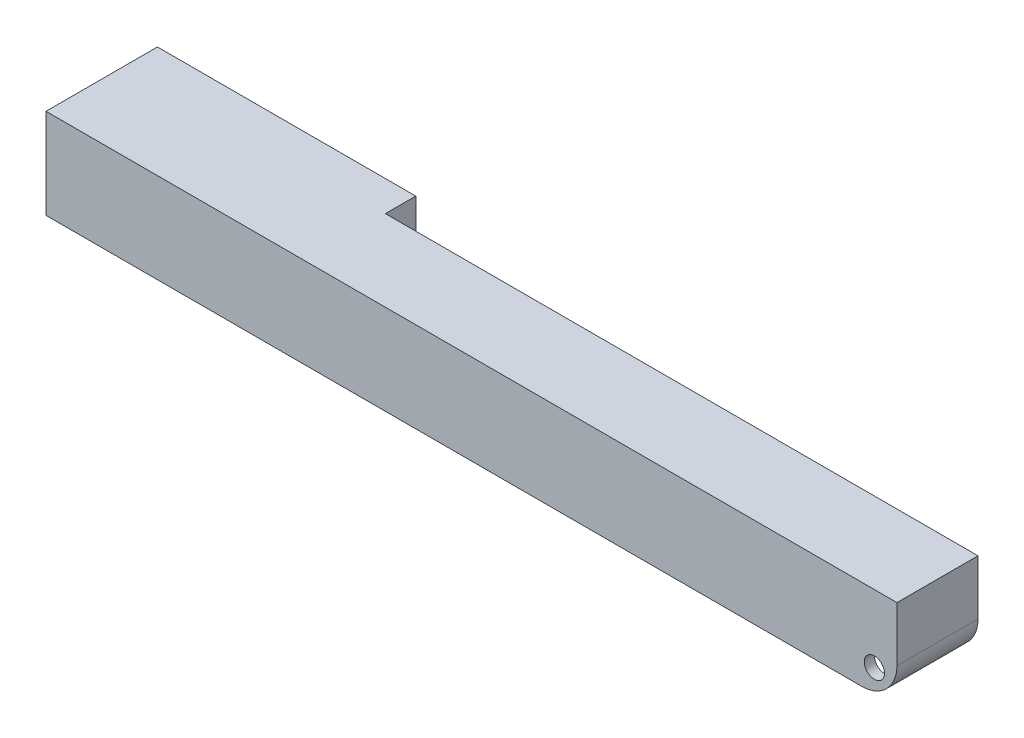
ISO-10303-21;
HEADER;
FILE_DESCRIPTION(('STEP AP214'),'2;1');
FILE_NAME('part.step','',(''),(''),'','','');
FILE_SCHEMA(('AUTOMOTIVE_DESIGN { 1 0 10303 214 1 1 1 1 }'));
ENDSEC;
DATA;
#1=APPLICATION_CONTEXT('core data for automotive mechanical design processes');
#2=APPLICATION_PROTOCOL_DEFINITION('international standard','automotive_design',2000,#1);
#3=PRODUCT_CONTEXT('',#1,'mechanical');
#4=PRODUCT('Part','Part','',(#3));
#5=PRODUCT_RELATED_PRODUCT_CATEGORY('part','',(#4));
#6=PRODUCT_DEFINITION_FORMATION('','',#4);
#7=PRODUCT_DEFINITION_CONTEXT('part definition',#1,'design');
#8=PRODUCT_DEFINITION('design','',#6,#7);
#9=PRODUCT_DEFINITION_SHAPE('','',#8);
#10=(LENGTH_UNIT() NAMED_UNIT(*) SI_UNIT(.MILLI.,.METRE.));
#11=(NAMED_UNIT(*) PLANE_ANGLE_UNIT() SI_UNIT($,.RADIAN.));
#12=(NAMED_UNIT(*) SI_UNIT($,.STERADIAN.) SOLID_ANGLE_UNIT());
#13=UNCERTAINTY_MEASURE_WITH_UNIT(LENGTH_MEASURE(1.E-05),#10,'distance_accuracy_value','');
#14=(GEOMETRIC_REPRESENTATION_CONTEXT(3) GLOBAL_UNCERTAINTY_ASSIGNED_CONTEXT((#13)) GLOBAL_UNIT_ASSIGNED_CONTEXT((#10,
#11,#12)) REPRESENTATION_CONTEXT('',''));
#15=CARTESIAN_POINT('',(0.,0.,0.));
#16=DIRECTION('',(0.,0.,1.));
#17=DIRECTION('',(1.,0.,0.));
#18=AXIS2_PLACEMENT_3D('',#15,#16,#17);
#19=CARTESIAN_POINT('',(82.,164.984847789123,9.));
#20=DIRECTION('',(0.,0.,1.));
#21=DIRECTION('',(1.,0.,0.));
#22=AXIS2_PLACEMENT_3D('',#19,#20,#21);
#23=PLANE('',#22);
#24=CARTESIAN_POINT('',(79.55,-13.35,9.));
#25=DIRECTION('',(0.,0.,1.));
#26=DIRECTION('',(1.,0.,0.));
#27=AXIS2_PLACEMENT_3D('',#24,#25,#26);
#28=CIRCLE('',#27,2.);
#29=CARTESIAN_POINT('',(81.55,-13.35,9.));
#30=VERTEX_POINT('',#29);
#31=EDGE_CURVE('E292',#30,#30,#28,.F.);
#32=ORIENTED_EDGE('',*,*,#31,.F.);
#33=EDGE_LOOP('',(#32));
#34=FACE_BOUND('',#33,.T.);
#35=DIRECTION('',(0.,-1.,0.));
#36=VECTOR('',#35,1.);
#37=CARTESIAN_POINT('',(82.,164.984847789123,9.));
#38=LINE('',#37,#36);
#39=CARTESIAN_POINT('',(82.,-2.,9.));
#40=VERTEX_POINT('',#39);
#41=CARTESIAN_POINT('',(82.,-15.6989794855664,9.));
#42=VERTEX_POINT('',#41);
#43=EDGE_CURVE('E247',#40,#42,#38,.T.);
#44=ORIENTED_EDGE('',*,*,#43,.T.);
#45=CARTESIAN_POINT('',(77.,-10.8,9.));
#46=DIRECTION('',(0.,0.,1.));
#47=DIRECTION('',(1.,0.,0.));
#48=AXIS2_PLACEMENT_3D('',#45,#46,#47);
#49=CIRCLE('',#48,7.);
#50=CARTESIAN_POINT('',(77.,-17.8,9.));
#51=VERTEX_POINT('',#50);
#52=EDGE_CURVE('E56',#42,#51,#49,.F.);
#53=ORIENTED_EDGE('',*,*,#52,.T.);
#54=DIRECTION('',(-1.,0.,0.));
#55=VECTOR('',#54,1.);
#56=CARTESIAN_POINT('',(82.,-17.8,9.));
#57=LINE('',#56,#55);
#58=CARTESIAN_POINT('',(-82.,-17.8,8.99999999999998));
#59=VERTEX_POINT('',#58);
#60=EDGE_CURVE('E245',#51,#59,#57,.T.);
#61=ORIENTED_EDGE('',*,*,#60,.T.);
#62=DIRECTION('',(0.,-1.,0.));
#63=VECTOR('',#62,1.);
#64=CARTESIAN_POINT('',(-82.,164.984847789123,8.99999999999998));
#65=LINE('',#64,#63);
#66=CARTESIAN_POINT('',(-82.,-14.3,8.99999999999998));
#67=VERTEX_POINT('',#66);
#68=EDGE_CURVE('E303',#67,#59,#65,.T.);
#69=ORIENTED_EDGE('',*,*,#68,.F.);
#70=DIRECTION('',(1.,0.,0.));
#71=VECTOR('',#70,1.);
#72=CARTESIAN_POINT('',(-82.,-14.3,8.99999999999998));
#73=LINE('',#72,#71);
#74=CARTESIAN_POINT('',(-35.,-14.3,8.99999999999999));
#75=VERTEX_POINT('',#74);
#76=EDGE_CURVE('E695',#67,#75,#73,.T.);
#77=ORIENTED_EDGE('',*,*,#76,.T.);
#78=DIRECTION('',(0.,1.,0.));
#79=VECTOR('',#78,1.);
#80=CARTESIAN_POINT('',(-35.,-12.3,8.99999999999999));
#81=LINE('',#80,#79);
#82=CARTESIAN_POINT('',(-35.,-12.3,8.99999999999999));
#83=VERTEX_POINT('',#82);
#84=EDGE_CURVE('E260',#75,#83,#81,.T.);
#85=ORIENTED_EDGE('',*,*,#84,.T.);
#86=DIRECTION('',(-1.,0.,0.));
#87=VECTOR('',#86,1.);
#88=CARTESIAN_POINT('',(-82.,-12.3,8.99999999999998));
#89=LINE('',#88,#87);
#90=CARTESIAN_POINT('',(-82.,-12.3,8.99999999999998));
#91=VERTEX_POINT('',#90);
#92=EDGE_CURVE('E203',#83,#91,#89,.T.);
#93=ORIENTED_EDGE('',*,*,#92,.T.);
#94=CARTESIAN_POINT('',(-82.,-2.,8.99999999999998));
#95=VERTEX_POINT('',#94);
#96=EDGE_CURVE('E295',#95,#91,#65,.T.);
#97=ORIENTED_EDGE('',*,*,#96,.F.);
#98=DIRECTION('',(-1.,0.,0.));
#99=VECTOR('',#98,1.);
#100=CARTESIAN_POINT('',(82.,-2.,9.));
#101=LINE('',#100,#99);
#102=EDGE_CURVE('E308',#40,#95,#101,.T.);
#103=ORIENTED_EDGE('',*,*,#102,.F.);
#104=EDGE_LOOP('',(#44,#53,#61,#69,#77,#85,#93,#97,#103));
#105=FACE_BOUND('',#104,.T.);
#106=ADVANCED_FACE('F47',(#34,#105),#23,.F.);
#107=CARTESIAN_POINT('',(-82.,164.984847789123,8.99999999999998));
#108=DIRECTION('',(-1.,0.,0.));
#109=DIRECTION('',(0.,0.,1.));
#110=AXIS2_PLACEMENT_3D('',#107,#108,#109);
#111=PLANE('',#110);
#112=DIRECTION('',(0.,0.,-1.));
#113=VECTOR('',#112,1.);
#114=CARTESIAN_POINT('',(-82.,-14.3,56.0425339453563));
#115=LINE('',#114,#113);
#116=CARTESIAN_POINT('',(-82.,-14.3,-9.));
#117=VERTEX_POINT('',#116);
#118=EDGE_CURVE('E633',#67,#117,#115,.T.);
#119=ORIENTED_EDGE('',*,*,#118,.F.);
#120=ORIENTED_EDGE('',*,*,#68,.T.);
#121=DIRECTION('',(0.,0.,-1.));
#122=VECTOR('',#121,1.);
#123=CARTESIAN_POINT('',(-82.,-17.8,8.99999999999998));
#124=LINE('',#123,#122);
#125=CARTESIAN_POINT('',(-82.,-17.8,-9.));
#126=VERTEX_POINT('',#125);
#127=EDGE_CURVE('E258',#59,#126,#124,.T.);
#128=ORIENTED_EDGE('',*,*,#127,.T.);
#129=DIRECTION('',(0.,-1.,0.));
#130=VECTOR('',#129,1.);
#131=CARTESIAN_POINT('',(-82.,164.984847789123,-9.));
#132=LINE('',#131,#130);
#133=EDGE_CURVE('E658',#117,#126,#132,.T.);
#134=ORIENTED_EDGE('',*,*,#133,.F.);
#135=EDGE_LOOP('',(#119,#120,#128,#134));
#136=FACE_BOUND('',#135,.T.);
#137=ADVANCED_FACE('F394',(#136),#111,.F.);
#138=DIRECTION('',(0.,0.,-1.));
#139=VECTOR('',#138,1.);
#140=CARTESIAN_POINT('',(-82.,-12.3,56.0425339453563));
#141=LINE('',#140,#139);
#142=CARTESIAN_POINT('',(-82.,-12.3,-9.));
#143=VERTEX_POINT('',#142);
#144=EDGE_CURVE('E630',#91,#143,#141,.T.);
#145=ORIENTED_EDGE('',*,*,#144,.T.);
#146=CARTESIAN_POINT('',(-82.,-2.,-9.));
#147=VERTEX_POINT('',#146);
#148=EDGE_CURVE('E199',#147,#143,#132,.T.);
#149=ORIENTED_EDGE('',*,*,#148,.F.);
#150=DIRECTION('',(0.,0.,-1.));
#151=VECTOR('',#150,1.);
#152=CARTESIAN_POINT('',(-82.,-2.,8.99999999999998));
#153=LINE('',#152,#151);
#154=EDGE_CURVE('E645',#95,#147,#153,.T.);
#155=ORIENTED_EDGE('',*,*,#154,.F.);
#156=ORIENTED_EDGE('',*,*,#96,.T.);
#157=EDGE_LOOP('',(#145,#149,#155,#156));
#158=FACE_BOUND('',#157,.T.);
#159=ADVANCED_FACE('F400',(#158),#111,.F.);
#160=CARTESIAN_POINT('',(-82.,164.984847789123,-9.));
#161=DIRECTION('',(0.,0.,-1.));
#162=DIRECTION('',(-1.,0.,0.));
#163=AXIS2_PLACEMENT_3D('',#160,#161,#162);
#164=PLANE('',#163);
#165=DIRECTION('',(1.,0.,0.));
#166=VECTOR('',#165,1.);
#167=CARTESIAN_POINT('',(-82.,-14.3,-9.));
#168=LINE('',#167,#166);
#169=CARTESIAN_POINT('',(-35.,-14.3,-9.));
#170=VERTEX_POINT('',#169);
#171=EDGE_CURVE('E637',#117,#170,#168,.T.);
#172=ORIENTED_EDGE('',*,*,#171,.F.);
#173=ORIENTED_EDGE('',*,*,#133,.T.);
#174=DIRECTION('',(1.,0.,0.));
#175=VECTOR('',#174,1.);
#176=CARTESIAN_POINT('',(-82.,-17.8,-9.));
#177=LINE('',#176,#175);
#178=CARTESIAN_POINT('',(-35.,-17.8,-9.));
#179=VERTEX_POINT('',#178);
#180=EDGE_CURVE('E650',#126,#179,#177,.T.);
#181=ORIENTED_EDGE('',*,*,#180,.T.);
#182=DIRECTION('',(0.,-1.,0.));
#183=VECTOR('',#182,1.);
#184=CARTESIAN_POINT('',(-35.,164.984847789123,-9.));
#185=LINE('',#184,#183);
#186=EDGE_CURVE('E192',#170,#179,#185,.T.);
#187=ORIENTED_EDGE('',*,*,#186,.F.);
#188=EDGE_LOOP('',(#172,#173,#181,#187));
#189=FACE_BOUND('',#188,.T.);
#190=ADVANCED_FACE('F417',(#189),#164,.F.);
#191=DIRECTION('',(-1.,0.,0.));
#192=VECTOR('',#191,1.);
#193=CARTESIAN_POINT('',(-82.,-12.3,-9.));
#194=LINE('',#193,#192);
#195=CARTESIAN_POINT('',(-35.,-12.3,-9.));
#196=VERTEX_POINT('',#195);
#197=EDGE_CURVE('E196',#196,#143,#194,.T.);
#198=ORIENTED_EDGE('',*,*,#197,.F.);
#199=CARTESIAN_POINT('',(-35.,-2.,-9.));
#200=VERTEX_POINT('',#199);
#201=EDGE_CURVE('E180',#200,#196,#185,.T.);
#202=ORIENTED_EDGE('',*,*,#201,.F.);
#203=DIRECTION('',(1.,0.,0.));
#204=VECTOR('',#203,1.);
#205=CARTESIAN_POINT('',(-82.,-2.,-9.));
#206=LINE('',#205,#204);
#207=EDGE_CURVE('E675',#147,#200,#206,.T.);
#208=ORIENTED_EDGE('',*,*,#207,.F.);
#209=ORIENTED_EDGE('',*,*,#148,.T.);
#210=EDGE_LOOP('',(#198,#202,#208,#209));
#211=FACE_BOUND('',#210,.T.);
#212=ADVANCED_FACE('F197',(#211),#164,.F.);
#213=CARTESIAN_POINT('',(-35.,164.984847789123,-9.));
#214=DIRECTION('',(1.,0.,0.));
#215=DIRECTION('',(0.,0.,-1.));
#216=AXIS2_PLACEMENT_3D('',#213,#214,#215);
#217=PLANE('',#216);
#218=DIRECTION('',(0.,0.,1.));
#219=VECTOR('',#218,1.);
#220=CARTESIAN_POINT('',(-35.,-14.3,-9.));
#221=LINE('',#220,#219);
#222=CARTESIAN_POINT('',(-35.,-14.3,-3.));
#223=VERTEX_POINT('',#222);
#224=EDGE_CURVE('E211',#170,#223,#221,.T.);
#225=ORIENTED_EDGE('',*,*,#224,.F.);
#226=ORIENTED_EDGE('',*,*,#186,.T.);
#227=DIRECTION('',(0.,0.,1.));
#228=VECTOR('',#227,1.);
#229=CARTESIAN_POINT('',(-35.,-17.8,-9.));
#230=LINE('',#229,#228);
#231=CARTESIAN_POINT('',(-35.,-17.8,-3.));
#232=VERTEX_POINT('',#231);
#233=EDGE_CURVE('E646',#179,#232,#230,.T.);
#234=ORIENTED_EDGE('',*,*,#233,.T.);
#235=DIRECTION('',(0.,-1.,0.));
#236=VECTOR('',#235,1.);
#237=CARTESIAN_POINT('',(-35.,164.984847789123,-3.));
#238=LINE('',#237,#236);
#239=EDGE_CURVE('E674',#223,#232,#238,.T.);
#240=ORIENTED_EDGE('',*,*,#239,.F.);
#241=EDGE_LOOP('',(#225,#226,#234,#240));
#242=FACE_BOUND('',#241,.T.);
#243=ADVANCED_FACE('F388',(#242),#217,.F.);
#244=DIRECTION('',(0.,0.,-1.));
#245=VECTOR('',#244,1.);
#246=CARTESIAN_POINT('',(-35.,-12.3,-9.));
#247=LINE('',#246,#245);
#248=CARTESIAN_POINT('',(-35.,-12.3,-3.));
#249=VERTEX_POINT('',#248);
#250=EDGE_CURVE('E185',#249,#196,#247,.T.);
#251=ORIENTED_EDGE('',*,*,#250,.F.);
#252=CARTESIAN_POINT('',(-35.,-2.,-3.));
#253=VERTEX_POINT('',#252);
#254=EDGE_CURVE('E671',#253,#249,#238,.T.);
#255=ORIENTED_EDGE('',*,*,#254,.F.);
#256=DIRECTION('',(0.,0.,1.));
#257=VECTOR('',#256,1.);
#258=CARTESIAN_POINT('',(-35.,-2.,-9.));
#259=LINE('',#258,#257);
#260=EDGE_CURVE('E188',#200,#253,#259,.T.);
#261=ORIENTED_EDGE('',*,*,#260,.F.);
#262=ORIENTED_EDGE('',*,*,#201,.T.);
#263=EDGE_LOOP('',(#251,#255,#261,#262));
#264=FACE_BOUND('',#263,.T.);
#265=ADVANCED_FACE('F182',(#264),#217,.F.);
#266=CARTESIAN_POINT('',(79.55,-13.35,-16.6568542494924));
#267=DIRECTION('',(0.,0.,1.));
#268=DIRECTION('',(1.,0.,0.));
#269=AXIS2_PLACEMENT_3D('',#266,#267,#268);
#270=CYLINDRICAL_SURFACE('',#269,2.);
#271=CARTESIAN_POINT('',(79.55,-13.35,-3.));
#272=DIRECTION('',(0.,0.,-1.));
#273=DIRECTION('',(-1.,0.,0.));
#274=AXIS2_PLACEMENT_3D('',#271,#272,#273);
#275=CIRCLE('',#274,2.);
#276=CARTESIAN_POINT('',(77.55,-13.35,-3.));
#277=VERTEX_POINT('',#276);
#278=EDGE_CURVE('E222',#277,#277,#275,.F.);
#279=ORIENTED_EDGE('',*,*,#278,.T.);
#280=EDGE_LOOP('',(#279));
#281=FACE_BOUND('',#280,.T.);
#282=CARTESIAN_POINT('',(79.55,-13.35,-5.));
#283=DIRECTION('',(0.,0.,1.));
#284=DIRECTION('',(1.,0.,0.));
#285=AXIS2_PLACEMENT_3D('',#282,#283,#284);
#286=CIRCLE('',#285,2.);
#287=CARTESIAN_POINT('',(81.55,-13.35,-5.));
#288=VERTEX_POINT('',#287);
#289=EDGE_CURVE('E287',#288,#288,#286,.F.);
#290=ORIENTED_EDGE('',*,*,#289,.T.);
#291=EDGE_LOOP('',(#290));
#292=FACE_BOUND('',#291,.T.);
#293=ADVANCED_FACE('F379',(#281,#292),#270,.F.);
#294=CARTESIAN_POINT('',(-84.,-17.8,11.));
#295=DIRECTION('',(0.,0.,1.));
#296=DIRECTION('',(1.,0.,0.));
#297=AXIS2_PLACEMENT_3D('',#294,#295,#296);
#298=PLANE('',#297);
#299=CARTESIAN_POINT('',(79.55,-13.35,11.));
#300=DIRECTION('',(0.,0.,1.));
#301=DIRECTION('',(1.,0.,0.));
#302=AXIS2_PLACEMENT_3D('',#299,#300,#301);
#303=CIRCLE('',#302,2.);
#304=CARTESIAN_POINT('',(81.55,-13.35,11.));
#305=VERTEX_POINT('',#304);
#306=EDGE_CURVE('E290',#305,#305,#303,.T.);
#307=ORIENTED_EDGE('',*,*,#306,.F.);
#308=EDGE_LOOP('',(#307));
#309=FACE_BOUND('',#308,.T.);
#310=DIRECTION('',(1.,0.,0.));
#311=VECTOR('',#310,1.);
#312=CARTESIAN_POINT('',(-84.,-17.8,11.));
#313=LINE('',#312,#311);
#314=CARTESIAN_POINT('',(-84.,-17.8,11.));
#315=VERTEX_POINT('',#314);
#316=CARTESIAN_POINT('',(77.,-17.8,11.));
#317=VERTEX_POINT('',#316);
#318=EDGE_CURVE('E270',#315,#317,#313,.T.);
#319=ORIENTED_EDGE('',*,*,#318,.T.);
#320=CARTESIAN_POINT('',(77.,-10.8,11.));
#321=DIRECTION('',(0.,0.,1.));
#322=DIRECTION('',(1.,0.,0.));
#323=AXIS2_PLACEMENT_3D('',#320,#321,#322);
#324=CIRCLE('',#323,7.);
#325=CARTESIAN_POINT('',(84.,-10.8,11.));
#326=VERTEX_POINT('',#325);
#327=EDGE_CURVE('E12',#317,#326,#324,.T.);
#328=ORIENTED_EDGE('',*,*,#327,.T.);
#329=DIRECTION('',(0.,1.,0.));
#330=VECTOR('',#329,1.);
#331=CARTESIAN_POINT('',(84.,-17.8,11.));
#332=LINE('',#331,#330);
#333=CARTESIAN_POINT('',(84.,0.,11.));
#334=VERTEX_POINT('',#333);
#335=EDGE_CURVE('E268',#326,#334,#332,.T.);
#336=ORIENTED_EDGE('',*,*,#335,.T.);
#337=DIRECTION('',(1.,0.,0.));
#338=VECTOR('',#337,1.);
#339=CARTESIAN_POINT('',(-84.,0.,11.));
#340=LINE('',#339,#338);
#341=CARTESIAN_POINT('',(-84.,0.,11.));
#342=VERTEX_POINT('',#341);
#343=EDGE_CURVE('E335',#342,#334,#340,.T.);
#344=ORIENTED_EDGE('',*,*,#343,.F.);
#345=DIRECTION('',(0.,1.,0.));
#346=VECTOR('',#345,1.);
#347=CARTESIAN_POINT('',(-84.,-17.8,11.));
#348=LINE('',#347,#346);
#349=EDGE_CURVE('E212',#315,#342,#348,.T.);
#350=ORIENTED_EDGE('',*,*,#349,.F.);
#351=EDGE_LOOP('',(#319,#328,#336,#344,#350));
#352=FACE_BOUND('',#351,.T.);
#353=ADVANCED_FACE('F266',(#309,#352),#298,.T.);
#354=CARTESIAN_POINT('',(-84.,-17.8,11.));
#355=DIRECTION('',(1.,0.,0.));
#356=DIRECTION('',(0.,0.,-1.));
#357=AXIS2_PLACEMENT_3D('',#354,#355,#356);
#358=PLANE('',#357);
#359=DIRECTION('',(0.,0.,-1.));
#360=VECTOR('',#359,1.);
#361=CARTESIAN_POINT('',(-84.,0.,11.));
#362=LINE('',#361,#360);
#363=CARTESIAN_POINT('',(-84.,0.,-11.));
#364=VERTEX_POINT('',#363);
#365=EDGE_CURVE('E338',#342,#364,#362,.T.);
#366=ORIENTED_EDGE('',*,*,#365,.T.);
#367=DIRECTION('',(0.,1.,0.));
#368=VECTOR('',#367,1.);
#369=CARTESIAN_POINT('',(-84.,-17.8,-11.));
#370=LINE('',#369,#368);
#371=CARTESIAN_POINT('',(-84.,-17.8,-11.));
#372=VERTEX_POINT('',#371);
#373=EDGE_CURVE('E219',#372,#364,#370,.T.);
#374=ORIENTED_EDGE('',*,*,#373,.F.);
#375=DIRECTION('',(0.,0.,-1.));
#376=VECTOR('',#375,1.);
#377=CARTESIAN_POINT('',(-84.,-17.8,11.));
#378=LINE('',#377,#376);
#379=EDGE_CURVE('E278',#315,#372,#378,.T.);
#380=ORIENTED_EDGE('',*,*,#379,.F.);
#381=ORIENTED_EDGE('',*,*,#349,.T.);
#382=EDGE_LOOP('',(#366,#374,#380,#381));
#383=FACE_BOUND('',#382,.T.);
#384=ADVANCED_FACE('F354',(#383),#358,.F.);
#385=CARTESIAN_POINT('',(-84.,-17.8,-11.));
#386=DIRECTION('',(0.,0.,1.));
#387=DIRECTION('',(1.,0.,0.));
#388=AXIS2_PLACEMENT_3D('',#385,#386,#387);
#389=PLANE('',#388);
#390=DIRECTION('',(1.,0.,0.));
#391=VECTOR('',#390,1.);
#392=CARTESIAN_POINT('',(-84.,0.,-11.));
#393=LINE('',#392,#391);
#394=CARTESIAN_POINT('',(-33.,0.,-11.));
#395=VERTEX_POINT('',#394);
#396=EDGE_CURVE('E346',#364,#395,#393,.T.);
#397=ORIENTED_EDGE('',*,*,#396,.T.);
#398=DIRECTION('',(0.,1.,0.));
#399=VECTOR('',#398,1.);
#400=CARTESIAN_POINT('',(-33.,-134.9537451386,-11.));
#401=LINE('',#400,#399);
#402=CARTESIAN_POINT('',(-33.,-17.8,-11.));
#403=VERTEX_POINT('',#402);
#404=EDGE_CURVE('E324',#403,#395,#401,.T.);
#405=ORIENTED_EDGE('',*,*,#404,.F.);
#406=DIRECTION('',(1.,0.,0.));
#407=VECTOR('',#406,1.);
#408=CARTESIAN_POINT('',(-84.,-17.8,-11.));
#409=LINE('',#408,#407);
#410=EDGE_CURVE('E284',#372,#403,#409,.T.);
#411=ORIENTED_EDGE('',*,*,#410,.F.);
#412=ORIENTED_EDGE('',*,*,#373,.T.);
#413=EDGE_LOOP('',(#397,#405,#411,#412));
#414=FACE_BOUND('',#413,.T.);
#415=ADVANCED_FACE('F360',(#414),#389,.F.);
#416=CARTESIAN_POINT('',(84.,-17.8,11.));
#417=DIRECTION('',(1.,0.,0.));
#418=DIRECTION('',(0.,0.,-1.));
#419=AXIS2_PLACEMENT_3D('',#416,#417,#418);
#420=PLANE('',#419);
#421=ORIENTED_EDGE('',*,*,#335,.F.);
#422=DIRECTION('',(0.,0.,-1.));
#423=VECTOR('',#422,1.);
#424=CARTESIAN_POINT('',(84.,-10.8,-5.));
#425=LINE('',#424,#423);
#426=CARTESIAN_POINT('',(84.,-10.8,-5.));
#427=VERTEX_POINT('',#426);
#428=EDGE_CURVE('E217',#326,#427,#425,.T.);
#429=ORIENTED_EDGE('',*,*,#428,.T.);
#430=DIRECTION('',(0.,1.,0.));
#431=VECTOR('',#430,1.);
#432=CARTESIAN_POINT('',(84.,-134.9537451386,-5.));
#433=LINE('',#432,#431);
#434=CARTESIAN_POINT('',(84.,0.,-5.));
#435=VERTEX_POINT('',#434);
#436=EDGE_CURVE('E314',#427,#435,#433,.T.);
#437=ORIENTED_EDGE('',*,*,#436,.T.);
#438=DIRECTION('',(0.,0.,-1.));
#439=VECTOR('',#438,1.);
#440=CARTESIAN_POINT('',(84.,0.,11.));
#441=LINE('',#440,#439);
#442=EDGE_CURVE('E275',#334,#435,#441,.T.);
#443=ORIENTED_EDGE('',*,*,#442,.F.);
#444=EDGE_LOOP('',(#421,#429,#437,#443));
#445=FACE_BOUND('',#444,.T.);
#446=ADVANCED_FACE('F272',(#445),#420,.T.);
#447=CARTESIAN_POINT('',(0.,-17.8,0.));
#448=DIRECTION('',(0.,1.,0.));
#449=DIRECTION('',(0.,0.,1.));
#450=AXIS2_PLACEMENT_3D('',#447,#448,#449);
#451=PLANE('',#450);
#452=DIRECTION('',(-1.,0.,0.));
#453=VECTOR('',#452,1.);
#454=CARTESIAN_POINT('',(-33.,-17.8,-5.));
#455=LINE('',#454,#453);
#456=CARTESIAN_POINT('',(77.,-17.8,-5.));
#457=VERTEX_POINT('',#456);
#458=CARTESIAN_POINT('',(-33.,-17.8,-5.));
#459=VERTEX_POINT('',#458);
#460=EDGE_CURVE('E291',#457,#459,#455,.T.);
#461=ORIENTED_EDGE('',*,*,#460,.F.);
#462=DIRECTION('',(0.,0.,-1.));
#463=VECTOR('',#462,1.);
#464=CARTESIAN_POINT('',(77.,-17.8,11.));
#465=LINE('',#464,#463);
#466=CARTESIAN_POINT('',(77.,-17.8,-3.));
#467=VERTEX_POINT('',#466);
#468=EDGE_CURVE('E234',#457,#467,#465,.F.);
#469=ORIENTED_EDGE('',*,*,#468,.T.);
#470=DIRECTION('',(1.,0.,0.));
#471=VECTOR('',#470,1.);
#472=CARTESIAN_POINT('',(-35.,-17.8,-3.));
#473=LINE('',#472,#471);
#474=EDGE_CURVE('E642',#232,#467,#473,.T.);
#475=ORIENTED_EDGE('',*,*,#474,.F.);
#476=ORIENTED_EDGE('',*,*,#233,.F.);
#477=ORIENTED_EDGE('',*,*,#180,.F.);
#478=ORIENTED_EDGE('',*,*,#127,.F.);
#479=ORIENTED_EDGE('',*,*,#60,.F.);
#480=DIRECTION('',(0.,0.,-1.));
#481=VECTOR('',#480,1.);
#482=CARTESIAN_POINT('',(77.,-17.8,11.));
#483=LINE('',#482,#481);
#484=EDGE_CURVE('E231',#51,#317,#483,.F.);
#485=ORIENTED_EDGE('',*,*,#484,.T.);
#486=ORIENTED_EDGE('',*,*,#318,.F.);
#487=ORIENTED_EDGE('',*,*,#379,.T.);
#488=ORIENTED_EDGE('',*,*,#410,.T.);
#489=DIRECTION('',(0.,0.,-1.));
#490=VECTOR('',#489,1.);
#491=CARTESIAN_POINT('',(-33.,-17.8,-11.));
#492=LINE('',#491,#490);
#493=EDGE_CURVE('E311',#459,#403,#492,.T.);
#494=ORIENTED_EDGE('',*,*,#493,.F.);
#495=EDGE_LOOP('',(#461,#469,#475,#476,#477,#478,#479,#485,#486,#487,#488,#494));
#496=FACE_BOUND('',#495,.T.);
#497=ADVANCED_FACE('F253',(#496),#451,.F.);
#498=CARTESIAN_POINT('',(0.,0.,0.));
#499=DIRECTION('',(0.,1.,0.));
#500=DIRECTION('',(0.,0.,1.));
#501=AXIS2_PLACEMENT_3D('',#498,#499,#500);
#502=PLANE('',#501);
#503=DIRECTION('',(1.,0.,0.));
#504=VECTOR('',#503,1.);
#505=CARTESIAN_POINT('',(-33.,0.,-5.));
#506=LINE('',#505,#504);
#507=CARTESIAN_POINT('',(-33.,0.,-5.));
#508=VERTEX_POINT('',#507);
#509=EDGE_CURVE('E320',#508,#435,#506,.T.);
#510=ORIENTED_EDGE('',*,*,#509,.F.);
#511=DIRECTION('',(0.,0.,1.));
#512=VECTOR('',#511,1.);
#513=CARTESIAN_POINT('',(-33.,0.,-11.));
#514=LINE('',#513,#512);
#515=EDGE_CURVE('E301',#395,#508,#514,.T.);
#516=ORIENTED_EDGE('',*,*,#515,.F.);
#517=ORIENTED_EDGE('',*,*,#396,.F.);
#518=ORIENTED_EDGE('',*,*,#365,.F.);
#519=ORIENTED_EDGE('',*,*,#343,.T.);
#520=ORIENTED_EDGE('',*,*,#442,.T.);
#521=EDGE_LOOP('',(#510,#516,#517,#518,#519,#520));
#522=FACE_BOUND('',#521,.T.);
#523=ADVANCED_FACE('F364',(#522),#502,.T.);
#524=ORIENTED_EDGE('',*,*,#31,.T.);
#525=EDGE_LOOP('',(#524));
#526=FACE_BOUND('',#525,.T.);
#527=ORIENTED_EDGE('',*,*,#306,.T.);
#528=EDGE_LOOP('',(#527));
#529=FACE_BOUND('',#528,.T.);
#530=ADVANCED_FACE('F375',(#526,#529),#270,.F.);
#531=CARTESIAN_POINT('',(-33.,-134.9537451386,-5.));
#532=DIRECTION('',(0.,0.,1.));
#533=DIRECTION('',(1.,0.,0.));
#534=AXIS2_PLACEMENT_3D('',#531,#532,#533);
#535=PLANE('',#534);
#536=ORIENTED_EDGE('',*,*,#436,.F.);
#537=CARTESIAN_POINT('',(77.,-10.8,-5.));
#538=DIRECTION('',(0.,0.,1.));
#539=DIRECTION('',(1.,0.,0.));
#540=AXIS2_PLACEMENT_3D('',#537,#538,#539);
#541=CIRCLE('',#540,7.);
#542=EDGE_CURVE('E228',#427,#457,#541,.F.);
#543=ORIENTED_EDGE('',*,*,#542,.T.);
#544=ORIENTED_EDGE('',*,*,#460,.T.);
#545=DIRECTION('',(0.,1.,0.));
#546=VECTOR('',#545,1.);
#547=CARTESIAN_POINT('',(-33.,-134.9537451386,-5.));
#548=LINE('',#547,#546);
#549=EDGE_CURVE('E327',#459,#508,#548,.T.);
#550=ORIENTED_EDGE('',*,*,#549,.T.);
#551=ORIENTED_EDGE('',*,*,#509,.T.);
#552=EDGE_LOOP('',(#536,#543,#544,#550,#551));
#553=FACE_BOUND('',#552,.T.);
#554=ORIENTED_EDGE('',*,*,#289,.F.);
#555=EDGE_LOOP('',(#554));
#556=FACE_BOUND('',#555,.T.);
#557=ADVANCED_FACE('F372',(#553,#556),#535,.F.);
#558=CARTESIAN_POINT('',(-33.,-134.9537451386,-11.));
#559=DIRECTION('',(-1.,0.,0.));
#560=DIRECTION('',(0.,0.,1.));
#561=AXIS2_PLACEMENT_3D('',#558,#559,#560);
#562=PLANE('',#561);
#563=ORIENTED_EDGE('',*,*,#493,.T.);
#564=ORIENTED_EDGE('',*,*,#404,.T.);
#565=ORIENTED_EDGE('',*,*,#515,.T.);
#566=ORIENTED_EDGE('',*,*,#549,.F.);
#567=EDGE_LOOP('',(#563,#564,#565,#566));
#568=FACE_BOUND('',#567,.T.);
#569=ADVANCED_FACE('F367',(#568),#562,.F.);
#570=CARTESIAN_POINT('',(-35.,164.984847789123,-3.));
#571=DIRECTION('',(0.,0.,-1.));
#572=DIRECTION('',(-1.,0.,0.));
#573=AXIS2_PLACEMENT_3D('',#570,#571,#572);
#574=PLANE('',#573);
#575=ORIENTED_EDGE('',*,*,#474,.T.);
#576=CARTESIAN_POINT('',(77.,-10.8,-3.));
#577=DIRECTION('',(0.,0.,-1.));
#578=DIRECTION('',(-1.,0.,0.));
#579=AXIS2_PLACEMENT_3D('',#576,#577,#578);
#580=CIRCLE('',#579,7.);
#581=CARTESIAN_POINT('',(82.,-15.6989794855664,-3.));
#582=VERTEX_POINT('',#581);
#583=EDGE_CURVE('E71',#467,#582,#580,.F.);
#584=ORIENTED_EDGE('',*,*,#583,.T.);
#585=DIRECTION('',(0.,-1.,0.));
#586=VECTOR('',#585,1.);
#587=CARTESIAN_POINT('',(82.,164.984847789123,-3.));
#588=LINE('',#587,#586);
#589=CARTESIAN_POINT('',(82.,-2.,-3.));
#590=VERTEX_POINT('',#589);
#591=EDGE_CURVE('E666',#590,#582,#588,.T.);
#592=ORIENTED_EDGE('',*,*,#591,.F.);
#593=DIRECTION('',(1.,0.,0.));
#594=VECTOR('',#593,1.);
#595=CARTESIAN_POINT('',(-35.,-2.,-3.));
#596=LINE('',#595,#594);
#597=EDGE_CURVE('E667',#253,#590,#596,.T.);
#598=ORIENTED_EDGE('',*,*,#597,.F.);
#599=ORIENTED_EDGE('',*,*,#254,.T.);
#600=EDGE_CURVE('E683',#249,#223,#238,.T.);
#601=ORIENTED_EDGE('',*,*,#600,.T.);
#602=ORIENTED_EDGE('',*,*,#239,.T.);
#603=EDGE_LOOP('',(#575,#584,#592,#598,#599,#601,#602));
#604=FACE_BOUND('',#603,.T.);
#605=ORIENTED_EDGE('',*,*,#278,.F.);
#606=EDGE_LOOP('',(#605));
#607=FACE_BOUND('',#606,.T.);
#608=ADVANCED_FACE('F412',(#604,#607),#574,.F.);
#609=CARTESIAN_POINT('',(0.,-2.,0.));
#610=DIRECTION('',(0.,1.,0.));
#611=DIRECTION('',(0.,0.,1.));
#612=AXIS2_PLACEMENT_3D('',#609,#610,#611);
#613=PLANE('',#612);
#614=ORIENTED_EDGE('',*,*,#102,.T.);
#615=ORIENTED_EDGE('',*,*,#154,.T.);
#616=ORIENTED_EDGE('',*,*,#207,.T.);
#617=ORIENTED_EDGE('',*,*,#260,.T.);
#618=ORIENTED_EDGE('',*,*,#597,.T.);
#619=DIRECTION('',(0.,0.,1.));
#620=VECTOR('',#619,1.);
#621=CARTESIAN_POINT('',(82.,-2.,-3.));
#622=LINE('',#621,#620);
#623=EDGE_CURVE('E662',#590,#40,#622,.T.);
#624=ORIENTED_EDGE('',*,*,#623,.T.);
#625=EDGE_LOOP('',(#614,#615,#616,#617,#618,#624));
#626=FACE_BOUND('',#625,.T.);
#627=ADVANCED_FACE('F411',(#626),#613,.F.);
#628=CARTESIAN_POINT('',(82.,164.984847789123,-3.));
#629=DIRECTION('',(1.,0.,0.));
#630=DIRECTION('',(0.,0.,-1.));
#631=AXIS2_PLACEMENT_3D('',#628,#629,#630);
#632=PLANE('',#631);
#633=ORIENTED_EDGE('',*,*,#591,.T.);
#634=DIRECTION('',(0.,0.,1.));
#635=VECTOR('',#634,1.);
#636=CARTESIAN_POINT('',(82.,-15.6989794855664,-3.));
#637=LINE('',#636,#635);
#638=EDGE_CURVE('E63',#582,#42,#637,.T.);
#639=ORIENTED_EDGE('',*,*,#638,.T.);
#640=ORIENTED_EDGE('',*,*,#43,.F.);
#641=ORIENTED_EDGE('',*,*,#623,.F.);
#642=EDGE_LOOP('',(#633,#639,#640,#641));
#643=FACE_BOUND('',#642,.T.);
#644=ADVANCED_FACE('F407',(#643),#632,.F.);
#645=CARTESIAN_POINT('',(-35.,-12.3,56.0425339453563));
#646=DIRECTION('',(-1.,0.,0.));
#647=DIRECTION('',(0.,0.,1.));
#648=AXIS2_PLACEMENT_3D('',#645,#646,#647);
#649=PLANE('',#648);
#650=DIRECTION('',(0.,0.,-1.));
#651=VECTOR('',#650,1.);
#652=CARTESIAN_POINT('',(-35.,-14.3,56.0425339453563));
#653=LINE('',#652,#651);
#654=EDGE_CURVE('E699',#75,#223,#653,.T.);
#655=ORIENTED_EDGE('',*,*,#654,.T.);
#656=ORIENTED_EDGE('',*,*,#600,.F.);
#657=DIRECTION('',(0.,0.,-1.));
#658=VECTOR('',#657,1.);
#659=CARTESIAN_POINT('',(-35.,-12.3,56.0425339453563));
#660=LINE('',#659,#658);
#661=EDGE_CURVE('E204',#83,#249,#660,.T.);
#662=ORIENTED_EDGE('',*,*,#661,.F.);
#663=ORIENTED_EDGE('',*,*,#84,.F.);
#664=EDGE_LOOP('',(#655,#656,#662,#663));
#665=FACE_BOUND('',#664,.T.);
#666=ADVANCED_FACE('F410',(#665),#649,.F.);
#667=CARTESIAN_POINT('',(-82.,-14.3,56.0425339453563));
#668=DIRECTION('',(0.,1.,0.));
#669=DIRECTION('',(0.,0.,1.));
#670=AXIS2_PLACEMENT_3D('',#667,#668,#669);
#671=PLANE('',#670);
#672=ORIENTED_EDGE('',*,*,#76,.F.);
#673=ORIENTED_EDGE('',*,*,#118,.T.);
#674=ORIENTED_EDGE('',*,*,#171,.T.);
#675=ORIENTED_EDGE('',*,*,#224,.T.);
#676=ORIENTED_EDGE('',*,*,#654,.F.);
#677=EDGE_LOOP('',(#672,#673,#674,#675,#676));
#678=FACE_BOUND('',#677,.T.);
#679=ADVANCED_FACE('F405',(#678),#671,.F.);
#680=CARTESIAN_POINT('',(-82.,-12.3,56.0425339453563));
#681=DIRECTION('',(0.,-1.,0.));
#682=DIRECTION('',(0.,0.,-1.));
#683=AXIS2_PLACEMENT_3D('',#680,#681,#682);
#684=PLANE('',#683);
#685=ORIENTED_EDGE('',*,*,#92,.F.);
#686=ORIENTED_EDGE('',*,*,#661,.T.);
#687=ORIENTED_EDGE('',*,*,#250,.T.);
#688=ORIENTED_EDGE('',*,*,#197,.T.);
#689=ORIENTED_EDGE('',*,*,#144,.F.);
#690=EDGE_LOOP('',(#685,#686,#687,#688,#689));
#691=FACE_BOUND('',#690,.T.);
#692=ADVANCED_FACE('F208',(#691),#684,.F.);
#693=CARTESIAN_POINT('',(77.,-10.8,11.));
#694=DIRECTION('',(0.,0.,1.));
#695=DIRECTION('',(1.,0.,0.));
#696=AXIS2_PLACEMENT_3D('',#693,#694,#695);
#697=CYLINDRICAL_SURFACE('',#696,7.);
#698=ORIENTED_EDGE('',*,*,#583,.F.);
#699=ORIENTED_EDGE('',*,*,#468,.F.);
#700=ORIENTED_EDGE('',*,*,#542,.F.);
#701=ORIENTED_EDGE('',*,*,#428,.F.);
#702=ORIENTED_EDGE('',*,*,#327,.F.);
#703=ORIENTED_EDGE('',*,*,#484,.F.);
#704=ORIENTED_EDGE('',*,*,#52,.F.);
#705=ORIENTED_EDGE('',*,*,#638,.F.);
#706=EDGE_LOOP('',(#698,#699,#700,#701,#702,#703,#704,#705));
#707=FACE_BOUND('',#706,.T.);
#708=ADVANCED_FACE('F49',(#707),#697,.T.);
#709=CLOSED_SHELL('',(#106,#137,#159,#190,#212,#243,#265,#293,#353,#384,#415,#446,#497,#523,
#530,#557,#569,#608,#627,#644,#666,#679,#692,#708));
#710=MANIFOLD_SOLID_BREP('B2',#709);
#711=ADVANCED_BREP_SHAPE_REPRESENTATION('',(#18,#710),#14);
#712=SHAPE_DEFINITION_REPRESENTATION(#9,#711);
ENDSEC;
END-ISO-10303-21;
